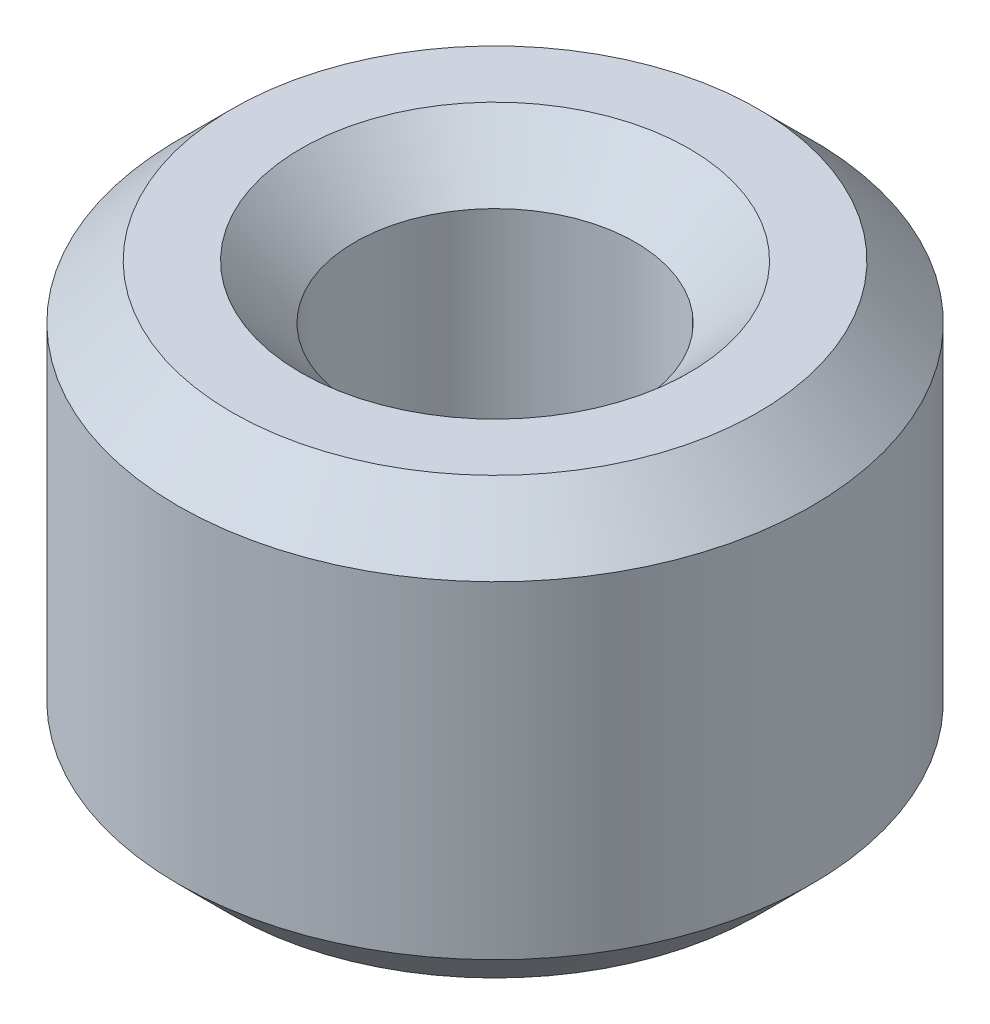
ISO-10303-21;
HEADER;
FILE_DESCRIPTION(('STEP AP214'),'2;1');
FILE_NAME('part.step','',(''),(''),'','','');
FILE_SCHEMA(('AUTOMOTIVE_DESIGN { 1 0 10303 214 1 1 1 1 }'));
ENDSEC;
DATA;
#1=APPLICATION_CONTEXT('core data for automotive mechanical design processes');
#2=APPLICATION_PROTOCOL_DEFINITION('international standard','automotive_design',2000,#1);
#3=PRODUCT_CONTEXT('',#1,'mechanical');
#4=PRODUCT('Part','Part','',(#3));
#5=PRODUCT_RELATED_PRODUCT_CATEGORY('part','',(#4));
#6=PRODUCT_DEFINITION_FORMATION('','',#4);
#7=PRODUCT_DEFINITION_CONTEXT('part definition',#1,'design');
#8=PRODUCT_DEFINITION('design','',#6,#7);
#9=PRODUCT_DEFINITION_SHAPE('','',#8);
#10=(LENGTH_UNIT() NAMED_UNIT(*) SI_UNIT(.MILLI.,.METRE.));
#11=(NAMED_UNIT(*) PLANE_ANGLE_UNIT() SI_UNIT($,.RADIAN.));
#12=(NAMED_UNIT(*) SI_UNIT($,.STERADIAN.) SOLID_ANGLE_UNIT());
#13=UNCERTAINTY_MEASURE_WITH_UNIT(LENGTH_MEASURE(1.E-05),#10,'distance_accuracy_value','');
#14=(GEOMETRIC_REPRESENTATION_CONTEXT(3) GLOBAL_UNCERTAINTY_ASSIGNED_CONTEXT((#13)) GLOBAL_UNIT_ASSIGNED_CONTEXT((#10,
#11,#12)) REPRESENTATION_CONTEXT('',''));
#15=CARTESIAN_POINT('',(0.,0.,0.));
#16=DIRECTION('',(0.,0.,1.));
#17=DIRECTION('',(1.,0.,0.));
#18=AXIS2_PLACEMENT_3D('',#15,#16,#17);
#19=CARTESIAN_POINT('',(0.,20.6002212552114,0.));
#20=DIRECTION('',(0.,-1.,0.));
#21=DIRECTION('',(0.,0.,-1.));
#22=AXIS2_PLACEMENT_3D('',#19,#20,#21);
#23=CYLINDRICAL_SURFACE('',#22,15.);
#24=CARTESIAN_POINT('',(0.,2.55526772593269,0.));
#25=DIRECTION('',(0.,1.,0.));
#26=DIRECTION('',(0.,0.,1.));
#27=AXIS2_PLACEMENT_3D('',#24,#25,#26);
#28=CIRCLE('',#27,15.);
#29=CARTESIAN_POINT('',(0.,2.55526772593269,15.));
#30=VERTEX_POINT('',#29);
#31=EDGE_CURVE('E10',#30,#30,#28,.T.);
#32=ORIENTED_EDGE('',*,*,#31,.T.);
#33=EDGE_LOOP('',(#32));
#34=FACE_BOUND('',#33,.T.);
#35=CARTESIAN_POINT('',(0.,18.0449535292787,0.));
#36=DIRECTION('',(0.,1.,0.));
#37=DIRECTION('',(0.,0.,1.));
#38=AXIS2_PLACEMENT_3D('',#35,#36,#37);
#39=CIRCLE('',#38,15.);
#40=CARTESIAN_POINT('',(0.,18.0449535292787,15.));
#41=VERTEX_POINT('',#40);
#42=EDGE_CURVE('E50',#41,#41,#39,.F.);
#43=ORIENTED_EDGE('',*,*,#42,.T.);
#44=EDGE_LOOP('',(#43));
#45=FACE_BOUND('',#44,.T.);
#46=ADVANCED_FACE('F39',(#34,#45),#23,.T.);
#47=CARTESIAN_POINT('',(0.,20.6002212552114,0.));
#48=DIRECTION('',(0.,1.,0.));
#49=DIRECTION('',(0.,0.,1.));
#50=AXIS2_PLACEMENT_3D('',#47,#48,#49);
#51=PLANE('',#50);
#52=CARTESIAN_POINT('',(0.,20.6002212552114,0.));
#53=DIRECTION('',(0.,1.,0.));
#54=DIRECTION('',(0.,0.,1.));
#55=AXIS2_PLACEMENT_3D('',#52,#53,#54);
#56=CIRCLE('',#55,9.18656254703893);
#57=CARTESIAN_POINT('',(0.,20.6002212552114,9.18656254703893));
#58=VERTEX_POINT('',#57);
#59=EDGE_CURVE('E58',#58,#58,#56,.F.);
#60=ORIENTED_EDGE('',*,*,#59,.T.);
#61=EDGE_LOOP('',(#60));
#62=FACE_BOUND('',#61,.T.);
#63=CARTESIAN_POINT('',(0.,20.6002212552114,0.));
#64=DIRECTION('',(0.,1.,0.));
#65=DIRECTION('',(0.,0.,1.));
#66=AXIS2_PLACEMENT_3D('',#63,#64,#65);
#67=CIRCLE('',#66,12.4447322740673);
#68=CARTESIAN_POINT('',(0.,20.6002212552114,12.4447322740673));
#69=VERTEX_POINT('',#68);
#70=EDGE_CURVE('E61',#69,#69,#67,.T.);
#71=ORIENTED_EDGE('',*,*,#70,.T.);
#72=EDGE_LOOP('',(#71));
#73=FACE_BOUND('',#72,.T.);
#74=ADVANCED_FACE('F88',(#62,#73),#51,.T.);
#75=CARTESIAN_POINT('',(0.,0.,0.));
#76=DIRECTION('',(0.,1.,0.));
#77=DIRECTION('',(0.,0.,1.));
#78=AXIS2_PLACEMENT_3D('',#75,#76,#77);
#79=PLANE('',#78);
#80=CARTESIAN_POINT('',(0.,0.,0.));
#81=DIRECTION('',(0.,1.,0.));
#82=DIRECTION('',(0.,0.,1.));
#83=AXIS2_PLACEMENT_3D('',#80,#81,#82);
#84=CIRCLE('',#83,9.18656254703889);
#85=CARTESIAN_POINT('',(0.,0.,9.18656254703889));
#86=VERTEX_POINT('',#85);
#87=EDGE_CURVE('E51',#86,#86,#84,.T.);
#88=ORIENTED_EDGE('',*,*,#87,.T.);
#89=EDGE_LOOP('',(#88));
#90=FACE_BOUND('',#89,.T.);
#91=CARTESIAN_POINT('',(0.,0.,0.));
#92=DIRECTION('',(0.,1.,0.));
#93=DIRECTION('',(0.,0.,1.));
#94=AXIS2_PLACEMENT_3D('',#91,#92,#93);
#95=CIRCLE('',#94,12.4447322740673);
#96=CARTESIAN_POINT('',(0.,0.,12.4447322740673));
#97=VERTEX_POINT('',#96);
#98=EDGE_CURVE('E54',#97,#97,#95,.F.);
#99=ORIENTED_EDGE('',*,*,#98,.T.);
#100=EDGE_LOOP('',(#99));
#101=FACE_BOUND('',#100,.T.);
#102=ADVANCED_FACE('F83',(#90,#101),#79,.F.);
#103=CARTESIAN_POINT('',(0.,20.6002212552114,0.));
#104=DIRECTION('',(0.,-1.,0.));
#105=DIRECTION('',(0.,0.,-1.));
#106=AXIS2_PLACEMENT_3D('',#103,#104,#105);
#107=CYLINDRICAL_SURFACE('',#106,6.63129482110621);
#108=CARTESIAN_POINT('',(0.,18.0449535292787,0.));
#109=DIRECTION('',(0.,1.,0.));
#110=DIRECTION('',(0.,0.,1.));
#111=AXIS2_PLACEMENT_3D('',#108,#109,#110);
#112=CIRCLE('',#111,6.63129482110621);
#113=CARTESIAN_POINT('',(0.,18.0449535292787,6.63129482110621));
#114=VERTEX_POINT('',#113);
#115=EDGE_CURVE('E67',#114,#114,#112,.T.);
#116=ORIENTED_EDGE('',*,*,#115,.T.);
#117=EDGE_LOOP('',(#116));
#118=FACE_BOUND('',#117,.T.);
#119=CARTESIAN_POINT('',(0.,2.55526772593271,0.));
#120=DIRECTION('',(0.,1.,0.));
#121=DIRECTION('',(0.,0.,1.));
#122=AXIS2_PLACEMENT_3D('',#119,#120,#121);
#123=CIRCLE('',#122,6.63129482110621);
#124=CARTESIAN_POINT('',(0.,2.55526772593271,6.63129482110621));
#125=VERTEX_POINT('',#124);
#126=EDGE_CURVE('E69',#125,#125,#123,.F.);
#127=ORIENTED_EDGE('',*,*,#126,.T.);
#128=EDGE_LOOP('',(#127));
#129=FACE_BOUND('',#128,.T.);
#130=ADVANCED_FACE('F71',(#118,#129),#107,.F.);
#131=CARTESIAN_POINT('',(0.,18.0449535292787,0.));
#132=DIRECTION('',(0.,1.,0.));
#133=DIRECTION('',(0.,0.,1.));
#134=AXIS2_PLACEMENT_3D('',#131,#132,#133);
#135=CONICAL_SURFACE('',#134,6.63129482110621,0.785398163397454);
#136=ORIENTED_EDGE('',*,*,#59,.F.);
#137=EDGE_LOOP('',(#136));
#138=FACE_BOUND('',#137,.T.);
#139=ORIENTED_EDGE('',*,*,#115,.F.);
#140=EDGE_LOOP('',(#139));
#141=FACE_BOUND('',#140,.T.);
#142=ADVANCED_FACE('F77',(#138,#141),#135,.F.);
#143=CARTESIAN_POINT('',(0.,0.,0.));
#144=DIRECTION('',(0.,-1.,0.));
#145=DIRECTION('',(0.,0.,-1.));
#146=AXIS2_PLACEMENT_3D('',#143,#144,#145);
#147=CONICAL_SURFACE('',#146,9.18656254703889,0.785398163397444);
#148=ORIENTED_EDGE('',*,*,#126,.F.);
#149=EDGE_LOOP('',(#148));
#150=FACE_BOUND('',#149,.T.);
#151=ORIENTED_EDGE('',*,*,#87,.F.);
#152=EDGE_LOOP('',(#151));
#153=FACE_BOUND('',#152,.T.);
#154=ADVANCED_FACE('F73',(#150,#153),#147,.F.);
#155=CARTESIAN_POINT('',(0.,2.55526772593269,0.));
#156=DIRECTION('',(0.,1.,0.));
#157=DIRECTION('',(0.,0.,1.));
#158=AXIS2_PLACEMENT_3D('',#155,#156,#157);
#159=CONICAL_SURFACE('',#158,15.,0.785398163397452);
#160=ORIENTED_EDGE('',*,*,#98,.F.);
#161=EDGE_LOOP('',(#160));
#162=FACE_BOUND('',#161,.T.);
#163=ORIENTED_EDGE('',*,*,#31,.F.);
#164=EDGE_LOOP('',(#163));
#165=FACE_BOUND('',#164,.T.);
#166=ADVANCED_FACE('F76',(#162,#165),#159,.T.);
#167=CARTESIAN_POINT('',(0.,20.6002212552114,0.));
#168=DIRECTION('',(0.,-1.,0.));
#169=DIRECTION('',(0.,0.,-1.));
#170=AXIS2_PLACEMENT_3D('',#167,#168,#169);
#171=CONICAL_SURFACE('',#170,12.4447322740673,0.785398163397444);
#172=ORIENTED_EDGE('',*,*,#42,.F.);
#173=EDGE_LOOP('',(#172));
#174=FACE_BOUND('',#173,.T.);
#175=ORIENTED_EDGE('',*,*,#70,.F.);
#176=EDGE_LOOP('',(#175));
#177=FACE_BOUND('',#176,.T.);
#178=ADVANCED_FACE('F45',(#174,#177),#171,.T.);
#179=CLOSED_SHELL('',(#46,#74,#102,#130,#142,#154,#166,#178));
#180=MANIFOLD_SOLID_BREP('B2',#179);
#181=ADVANCED_BREP_SHAPE_REPRESENTATION('',(#18,#180),#14);
#182=SHAPE_DEFINITION_REPRESENTATION(#9,#181);
ENDSEC;
END-ISO-10303-21;
